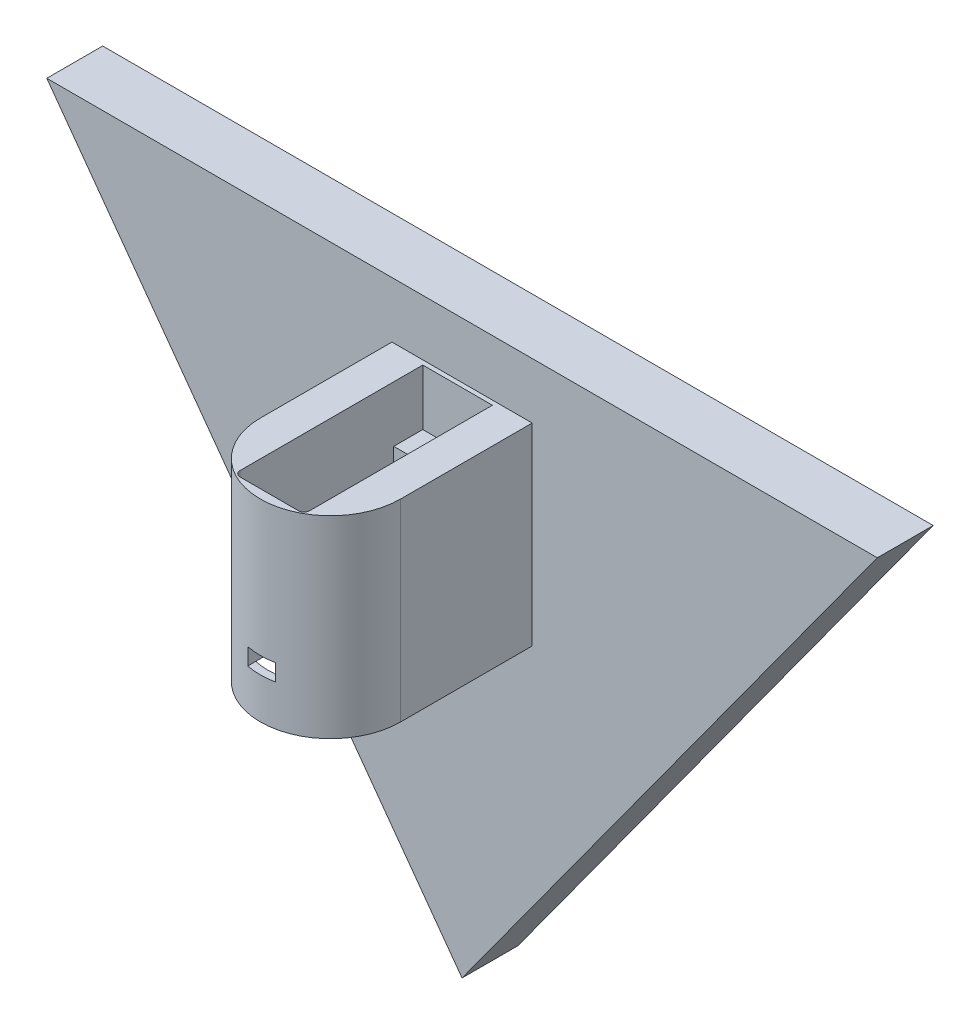
ISO-10303-21;
HEADER;
FILE_DESCRIPTION(('STEP AP214'),'2;1');
FILE_NAME('part.step','',(''),(''),'','','');
FILE_SCHEMA(('AUTOMOTIVE_DESIGN { 1 0 10303 214 1 1 1 1 }'));
ENDSEC;
DATA;
#1=APPLICATION_CONTEXT('core data for automotive mechanical design processes');
#2=APPLICATION_PROTOCOL_DEFINITION('international standard','automotive_design',2000,#1);
#3=PRODUCT_CONTEXT('',#1,'mechanical');
#4=PRODUCT('Part','Part','',(#3));
#5=PRODUCT_RELATED_PRODUCT_CATEGORY('part','',(#4));
#6=PRODUCT_DEFINITION_FORMATION('','',#4);
#7=PRODUCT_DEFINITION_CONTEXT('part definition',#1,'design');
#8=PRODUCT_DEFINITION('design','',#6,#7);
#9=PRODUCT_DEFINITION_SHAPE('','',#8);
#10=(LENGTH_UNIT() NAMED_UNIT(*) SI_UNIT(.MILLI.,.METRE.));
#11=(NAMED_UNIT(*) PLANE_ANGLE_UNIT() SI_UNIT($,.RADIAN.));
#12=(NAMED_UNIT(*) SI_UNIT($,.STERADIAN.) SOLID_ANGLE_UNIT());
#13=UNCERTAINTY_MEASURE_WITH_UNIT(LENGTH_MEASURE(1.E-05),#10,'distance_accuracy_value','');
#14=(GEOMETRIC_REPRESENTATION_CONTEXT(3) GLOBAL_UNCERTAINTY_ASSIGNED_CONTEXT((#13)) GLOBAL_UNIT_ASSIGNED_CONTEXT((#10,
#11,#12)) REPRESENTATION_CONTEXT('',''));
#15=CARTESIAN_POINT('',(0.,0.,0.));
#16=DIRECTION('',(0.,0.,1.));
#17=DIRECTION('',(1.,0.,0.));
#18=AXIS2_PLACEMENT_3D('',#15,#16,#17);
#19=CARTESIAN_POINT('',(-6.23,7.27500000000001,6.));
#20=DIRECTION('',(0.,-1.,0.));
#21=DIRECTION('',(0.,0.,-1.));
#22=AXIS2_PLACEMENT_3D('',#19,#20,#21);
#23=PLANE('',#22);
#24=DIRECTION('',(-1.,0.,0.));
#25=VECTOR('',#24,1.);
#26=CARTESIAN_POINT('',(-6.23,7.27500000000001,29.7));
#27=LINE('',#26,#25);
#28=CARTESIAN_POINT('',(0.,7.27500000000001,29.7));
#29=VERTEX_POINT('',#28);
#30=CARTESIAN_POINT('',(-6.23,7.27500000000001,29.7));
#31=VERTEX_POINT('',#30);
#32=EDGE_CURVE('E360',#29,#31,#27,.T.);
#33=ORIENTED_EDGE('',*,*,#32,.T.);
#34=DIRECTION('',(0.,0.,1.));
#35=VECTOR('',#34,1.);
#36=CARTESIAN_POINT('',(-6.23,7.27500000000001,0.8));
#37=LINE('',#36,#35);
#38=CARTESIAN_POINT('',(-6.23,7.27500000000001,33.5));
#39=VERTEX_POINT('',#38);
#40=EDGE_CURVE('E11',#31,#39,#37,.T.);
#41=ORIENTED_EDGE('',*,*,#40,.T.);
#42=CARTESIAN_POINT('',(-5.23,7.27500000000001,33.5));
#43=DIRECTION('',(0.,1.,0.));
#44=DIRECTION('',(0.,0.,1.));
#45=AXIS2_PLACEMENT_3D('',#42,#43,#44);
#46=CIRCLE('',#45,1.);
#47=CARTESIAN_POINT('',(-5.23,7.27500000000001,34.5));
#48=VERTEX_POINT('',#47);
#49=EDGE_CURVE('E263',#39,#48,#46,.T.);
#50=ORIENTED_EDGE('',*,*,#49,.T.);
#51=DIRECTION('',(1.,0.,0.));
#52=VECTOR('',#51,1.);
#53=CARTESIAN_POINT('',(-5.23,7.27500000000001,34.5));
#54=LINE('',#53,#52);
#55=CARTESIAN_POINT('',(-0.979795897113272,7.27500000000001,34.5));
#56=VERTEX_POINT('',#55);
#57=EDGE_CURVE('E261',#48,#56,#54,.T.);
#58=ORIENTED_EDGE('',*,*,#57,.T.);
#59=CARTESIAN_POINT('',(0.,7.27500000000001,32.2));
#60=DIRECTION('',(0.,-1.,0.));
#61=DIRECTION('',(0.,0.,-1.));
#62=AXIS2_PLACEMENT_3D('',#59,#60,#61);
#63=CIRCLE('',#62,2.5);
#64=EDGE_CURVE('E406',#56,#29,#63,.T.);
#65=ORIENTED_EDGE('',*,*,#64,.T.);
#66=EDGE_LOOP('',(#33,#41,#50,#58,#65));
#67=FACE_BOUND('',#66,.T.);
#68=ADVANCED_FACE('F41',(#67),#23,.F.);
#69=CARTESIAN_POINT('',(0.979795897113266,7.27500000000001,34.5));
#70=VERTEX_POINT('',#69);
#71=EDGE_CURVE('E407',#29,#70,#63,.T.);
#72=ORIENTED_EDGE('',*,*,#71,.T.);
#73=CARTESIAN_POINT('',(5.23,7.27500000000001,34.5));
#74=VERTEX_POINT('',#73);
#75=EDGE_CURVE('E51',#70,#74,#54,.T.);
#76=ORIENTED_EDGE('',*,*,#75,.T.);
#77=CARTESIAN_POINT('',(5.23,7.27500000000001,33.5));
#78=DIRECTION('',(0.,1.,0.));
#79=DIRECTION('',(0.,0.,1.));
#80=AXIS2_PLACEMENT_3D('',#77,#78,#79);
#81=CIRCLE('',#80,1.00000000000001);
#82=CARTESIAN_POINT('',(6.23,7.27500000000001,33.5));
#83=VERTEX_POINT('',#82);
#84=EDGE_CURVE('E266',#74,#83,#81,.T.);
#85=ORIENTED_EDGE('',*,*,#84,.T.);
#86=DIRECTION('',(0.,0.,-1.));
#87=VECTOR('',#86,1.);
#88=CARTESIAN_POINT('',(6.23,7.27500000000001,0.8));
#89=LINE('',#88,#87);
#90=CARTESIAN_POINT('',(6.23,7.27500000000001,29.7));
#91=VERTEX_POINT('',#90);
#92=EDGE_CURVE('E272',#83,#91,#89,.T.);
#93=ORIENTED_EDGE('',*,*,#92,.T.);
#94=EDGE_CURVE('E367',#91,#29,#27,.T.);
#95=ORIENTED_EDGE('',*,*,#94,.T.);
#96=EDGE_LOOP('',(#72,#76,#85,#93,#95));
#97=FACE_BOUND('',#96,.T.);
#98=ADVANCED_FACE('F440',(#97),#23,.F.);
#99=CARTESIAN_POINT('',(-6.23,-9.975,6.));
#100=DIRECTION('',(0.,1.,0.));
#101=DIRECTION('',(-1.,0.,0.));
#102=AXIS2_PLACEMENT_3D('',#99,#100,#101);
#103=PLANE('',#102);
#104=DIRECTION('',(0.,0.,1.));
#105=VECTOR('',#104,1.);
#106=CARTESIAN_POINT('',(2.5,-9.975,-0.001000000000001));
#107=LINE('',#106,#105);
#108=CARTESIAN_POINT('',(2.5,-9.975,29.7));
#109=VERTEX_POINT('',#108);
#110=CARTESIAN_POINT('',(2.5,-9.975,34.4161170617659));
#111=VERTEX_POINT('',#110);
#112=EDGE_CURVE('E340',#109,#111,#107,.T.);
#113=ORIENTED_EDGE('',*,*,#112,.F.);
#114=DIRECTION('',(1.,0.,0.));
#115=VECTOR('',#114,1.);
#116=CARTESIAN_POINT('',(-6.23000000000002,-9.975,29.7));
#117=LINE('',#116,#115);
#118=CARTESIAN_POINT('',(6.23,-9.97499999999999,29.7));
#119=VERTEX_POINT('',#118);
#120=EDGE_CURVE('E368',#109,#119,#117,.T.);
#121=ORIENTED_EDGE('',*,*,#120,.T.);
#122=DIRECTION('',(0.,0.,-1.));
#123=VECTOR('',#122,1.);
#124=CARTESIAN_POINT('',(6.23,-9.97499999999999,29.7));
#125=LINE('',#124,#123);
#126=CARTESIAN_POINT('',(6.23,-9.97499999999999,14.3028599015696));
#127=VERTEX_POINT('',#126);
#128=EDGE_CURVE('E362',#119,#127,#125,.T.);
#129=ORIENTED_EDGE('',*,*,#128,.T.);
#130=CARTESIAN_POINT('',(0.,-9.97499999999999,23.55));
#131=DIRECTION('',(0.,1.,0.));
#132=DIRECTION('',(-1.,0.,0.));
#133=AXIS2_PLACEMENT_3D('',#130,#131,#132);
#134=CIRCLE('',#133,11.15);
#135=EDGE_CURVE('E354',#111,#127,#134,.T.);
#136=ORIENTED_EDGE('',*,*,#135,.F.);
#137=EDGE_LOOP('',(#113,#121,#129,#136));
#138=FACE_BOUND('',#137,.T.);
#139=ADVANCED_FACE('F475',(#138),#103,.F.);
#140=CARTESIAN_POINT('',(-6.23,-53.9370800671778,29.7));
#141=DIRECTION('',(0.,0.,-1.));
#142=DIRECTION('',(-1.,0.,0.));
#143=AXIS2_PLACEMENT_3D('',#140,#141,#142);
#144=PLANE('',#143);
#145=DIRECTION('',(-1.,0.,0.));
#146=VECTOR('',#145,1.);
#147=CARTESIAN_POINT('',(-2.5,-6.975,29.7));
#148=LINE('',#147,#146);
#149=CARTESIAN_POINT('',(2.5,-6.975,29.7));
#150=VERTEX_POINT('',#149);
#151=CARTESIAN_POINT('',(-2.5,-6.975,29.7));
#152=VERTEX_POINT('',#151);
#153=EDGE_CURVE('E322',#150,#152,#148,.T.);
#154=ORIENTED_EDGE('',*,*,#153,.T.);
#155=DIRECTION('',(0.,-1.,0.));
#156=VECTOR('',#155,1.);
#157=CARTESIAN_POINT('',(-2.5,-6.975,29.7));
#158=LINE('',#157,#156);
#159=CARTESIAN_POINT('',(-2.5,-9.975,29.7));
#160=VERTEX_POINT('',#159);
#161=EDGE_CURVE('E329',#152,#160,#158,.T.);
#162=ORIENTED_EDGE('',*,*,#161,.T.);
#163=CARTESIAN_POINT('',(-6.23,-9.975,29.7));
#164=VERTEX_POINT('',#163);
#165=EDGE_CURVE('E388',#164,#160,#117,.T.);
#166=ORIENTED_EDGE('',*,*,#165,.F.);
#167=DIRECTION('',(0.,1.,0.));
#168=VECTOR('',#167,1.);
#169=CARTESIAN_POINT('',(-6.23,-53.9370800671778,29.7));
#170=LINE('',#169,#168);
#171=EDGE_CURVE('E382',#164,#31,#170,.T.);
#172=ORIENTED_EDGE('',*,*,#171,.T.);
#173=ORIENTED_EDGE('',*,*,#32,.F.);
#174=ORIENTED_EDGE('',*,*,#94,.F.);
#175=DIRECTION('',(0.,1.,0.));
#176=VECTOR('',#175,1.);
#177=CARTESIAN_POINT('',(6.23,-53.9370800671778,29.7));
#178=LINE('',#177,#176);
#179=EDGE_CURVE('E375',#119,#91,#178,.T.);
#180=ORIENTED_EDGE('',*,*,#179,.F.);
#181=ORIENTED_EDGE('',*,*,#120,.F.);
#182=DIRECTION('',(0.,1.,0.));
#183=VECTOR('',#182,1.);
#184=CARTESIAN_POINT('',(2.5,-6.975,29.7));
#185=LINE('',#184,#183);
#186=EDGE_CURVE('E323',#109,#150,#185,.T.);
#187=ORIENTED_EDGE('',*,*,#186,.T.);
#188=EDGE_LOOP('',(#154,#162,#166,#172,#173,#174,#180,#181,#187));
#189=FACE_BOUND('',#188,.T.);
#190=ADVANCED_FACE('F445',(#189),#144,.T.);
#191=DIRECTION('',(-1.,0.,0.));
#192=VECTOR('',#191,1.);
#193=CARTESIAN_POINT('',(-6.23,7.27500000000001,0.8));
#194=LINE('',#193,#192);
#195=CARTESIAN_POINT('',(6.23,7.27500000000001,0.8));
#196=VERTEX_POINT('',#195);
#197=CARTESIAN_POINT('',(-6.23,7.27500000000001,0.799999999999999));
#198=VERTEX_POINT('',#197);
#199=EDGE_CURVE('E249',#196,#198,#194,.T.);
#200=ORIENTED_EDGE('',*,*,#199,.T.);
#201=CARTESIAN_POINT('',(-6.23,7.27500000000001,6.));
#202=VERTEX_POINT('',#201);
#203=EDGE_CURVE('E52',#198,#202,#37,.T.);
#204=ORIENTED_EDGE('',*,*,#203,.T.);
#205=DIRECTION('',(-1.,0.,0.));
#206=VECTOR('',#205,1.);
#207=CARTESIAN_POINT('',(-6.23,7.27500000000001,6.));
#208=LINE('',#207,#206);
#209=CARTESIAN_POINT('',(0.,7.27500000000001,6.));
#210=VERTEX_POINT('',#209);
#211=EDGE_CURVE('E396',#210,#202,#208,.T.);
#212=ORIENTED_EDGE('',*,*,#211,.F.);
#213=CARTESIAN_POINT('',(0.,7.27500000000001,3.5));
#214=DIRECTION('',(0.,-1.,0.));
#215=DIRECTION('',(0.,0.,-1.));
#216=AXIS2_PLACEMENT_3D('',#213,#214,#215);
#217=CIRCLE('',#216,2.5);
#218=EDGE_CURVE('E403',#210,#210,#217,.T.);
#219=ORIENTED_EDGE('',*,*,#218,.T.);
#220=CARTESIAN_POINT('',(6.23,7.27500000000001,6.));
#221=VERTEX_POINT('',#220);
#222=EDGE_CURVE('E397',#221,#210,#208,.T.);
#223=ORIENTED_EDGE('',*,*,#222,.F.);
#224=EDGE_CURVE('E271',#221,#196,#89,.T.);
#225=ORIENTED_EDGE('',*,*,#224,.T.);
#226=EDGE_LOOP('',(#200,#204,#212,#219,#223,#225));
#227=FACE_BOUND('',#226,.T.);
#228=ADVANCED_FACE('F509',(#227),#23,.F.);
#229=CARTESIAN_POINT('',(0.,-53.9370800671778,23.55));
#230=DIRECTION('',(0.,1.,0.));
#231=DIRECTION('',(0.,0.,1.));
#232=AXIS2_PLACEMENT_3D('',#229,#230,#231);
#233=CYLINDRICAL_SURFACE('',#232,12.5467811820916);
#234=CARTESIAN_POINT('',(0.,-17.275,23.55));
#235=DIRECTION('',(0.,-1.,0.));
#236=DIRECTION('',(0.,0.,-1.));
#237=AXIS2_PLACEMENT_3D('',#234,#235,#236);
#238=CIRCLE('',#237,12.5467811820916);
#239=CARTESIAN_POINT('',(12.5467811820916,-17.275,23.55));
#240=VERTEX_POINT('',#239);
#241=CARTESIAN_POINT('',(-12.5467811820916,-17.275,23.55));
#242=VERTEX_POINT('',#241);
#243=EDGE_CURVE('E355',#240,#242,#238,.T.);
#244=ORIENTED_EDGE('',*,*,#243,.F.);
#245=DIRECTION('',(0.,1.,0.));
#246=VECTOR('',#245,1.);
#247=CARTESIAN_POINT('',(12.5467811820916,-53.9370800671778,23.55));
#248=LINE('',#247,#246);
#249=CARTESIAN_POINT('',(12.5467811820916,17.275,23.55));
#250=VERTEX_POINT('',#249);
#251=EDGE_CURVE('E376',#240,#250,#248,.T.);
#252=ORIENTED_EDGE('',*,*,#251,.T.);
#253=CARTESIAN_POINT('',(0.,17.275,23.55));
#254=DIRECTION('',(0.,1.,0.));
#255=DIRECTION('',(0.,0.,1.));
#256=AXIS2_PLACEMENT_3D('',#253,#254,#255);
#257=CIRCLE('',#256,12.5467811820916);
#258=CARTESIAN_POINT('',(-12.5467811820916,17.275,23.55));
#259=VERTEX_POINT('',#258);
#260=EDGE_CURVE('E293',#259,#250,#257,.T.);
#261=ORIENTED_EDGE('',*,*,#260,.F.);
#262=DIRECTION('',(0.,1.,0.));
#263=VECTOR('',#262,1.);
#264=CARTESIAN_POINT('',(-12.5467811820916,-53.9370800671778,23.55));
#265=LINE('',#264,#263);
#266=EDGE_CURVE('E67',#242,#259,#265,.T.);
#267=ORIENTED_EDGE('',*,*,#266,.F.);
#268=EDGE_LOOP('',(#244,#252,#261,#267));
#269=FACE_BOUND('',#268,.T.);
#270=CARTESIAN_POINT('',(0.,-9.975,23.55));
#271=DIRECTION('',(0.,-1.,0.));
#272=DIRECTION('',(0.,0.,-1.));
#273=AXIS2_PLACEMENT_3D('',#270,#271,#272);
#274=CIRCLE('',#273,12.5467811820916);
#275=CARTESIAN_POINT('',(2.5,-9.975,35.8451908497302));
#276=VERTEX_POINT('',#275);
#277=CARTESIAN_POINT('',(-2.5,-9.975,35.8451908497302));
#278=VERTEX_POINT('',#277);
#279=EDGE_CURVE('E309',#276,#278,#274,.T.);
#280=ORIENTED_EDGE('',*,*,#279,.T.);
#281=DIRECTION('',(0.,1.,0.));
#282=VECTOR('',#281,1.);
#283=CARTESIAN_POINT('',(-2.5,-53.9370800671778,35.8451908497302));
#284=LINE('',#283,#282);
#285=CARTESIAN_POINT('',(-2.5,-6.975,35.8451908497302));
#286=VERTEX_POINT('',#285);
#287=EDGE_CURVE('E313',#278,#286,#284,.T.);
#288=ORIENTED_EDGE('',*,*,#287,.T.);
#289=CARTESIAN_POINT('',(0.,-6.975,23.55));
#290=DIRECTION('',(0.,1.,0.));
#291=DIRECTION('',(0.,0.,1.));
#292=AXIS2_PLACEMENT_3D('',#289,#290,#291);
#293=CIRCLE('',#292,12.5467811820916);
#294=CARTESIAN_POINT('',(2.50000000000001,-6.975,35.8451908497302));
#295=VERTEX_POINT('',#294);
#296=EDGE_CURVE('E302',#286,#295,#293,.T.);
#297=ORIENTED_EDGE('',*,*,#296,.T.);
#298=DIRECTION('',(0.,1.,0.));
#299=VECTOR('',#298,1.);
#300=CARTESIAN_POINT('',(2.50000000000001,-53.9370800671778,35.8451908497302));
#301=LINE('',#300,#299);
#302=EDGE_CURVE('E312',#295,#276,#301,.F.);
#303=ORIENTED_EDGE('',*,*,#302,.T.);
#304=EDGE_LOOP('',(#280,#288,#297,#303));
#305=FACE_BOUND('',#304,.T.);
#306=ADVANCED_FACE('F483',(#269,#305),#233,.T.);
#307=CARTESIAN_POINT('',(0.,42.762656223683,23.55));
#308=DIRECTION('',(0.,-1.,0.));
#309=DIRECTION('',(0.,0.,-1.));
#310=AXIS2_PLACEMENT_3D('',#307,#308,#309);
#311=CYLINDRICAL_SURFACE('',#310,11.15);
#312=CARTESIAN_POINT('',(0.,-17.275,23.55));
#313=DIRECTION('',(0.,-1.,0.));
#314=DIRECTION('',(0.,0.,-1.));
#315=AXIS2_PLACEMENT_3D('',#312,#313,#314);
#316=CIRCLE('',#315,11.15);
#317=CARTESIAN_POINT('',(0.,-17.275,12.4));
#318=VERTEX_POINT('',#317);
#319=EDGE_CURVE('E349',#318,#318,#316,.T.);
#320=ORIENTED_EDGE('',*,*,#319,.T.);
#321=EDGE_LOOP('',(#320));
#322=FACE_BOUND('',#321,.T.);
#323=CARTESIAN_POINT('',(0.,-9.97499999999999,23.55));
#324=DIRECTION('',(0.,1.,0.));
#325=DIRECTION('',(-1.,0.,0.));
#326=AXIS2_PLACEMENT_3D('',#323,#324,#325);
#327=CIRCLE('',#326,11.15);
#328=CARTESIAN_POINT('',(-6.23,-9.97499999999999,14.3028599015696));
#329=VERTEX_POINT('',#328);
#330=EDGE_CURVE('E46',#329,#127,#327,.F.);
#331=ORIENTED_EDGE('',*,*,#330,.F.);
#332=CARTESIAN_POINT('',(-2.5,-9.975,34.4161170617659));
#333=VERTEX_POINT('',#332);
#334=EDGE_CURVE('E358',#329,#333,#134,.T.);
#335=ORIENTED_EDGE('',*,*,#334,.T.);
#336=EDGE_CURVE('E359',#333,#111,#134,.T.);
#337=ORIENTED_EDGE('',*,*,#336,.T.);
#338=ORIENTED_EDGE('',*,*,#135,.T.);
#339=EDGE_LOOP('',(#331,#335,#337,#338));
#340=FACE_BOUND('',#339,.T.);
#341=ADVANCED_FACE('F524',(#322,#340),#311,.F.);
#342=ORIENTED_EDGE('',*,*,#165,.T.);
#343=DIRECTION('',(0.,0.,1.));
#344=VECTOR('',#343,1.);
#345=CARTESIAN_POINT('',(-2.5,-9.975,-0.001000000000001));
#346=LINE('',#345,#344);
#347=EDGE_CURVE('E343',#160,#333,#346,.T.);
#348=ORIENTED_EDGE('',*,*,#347,.T.);
#349=ORIENTED_EDGE('',*,*,#334,.F.);
#350=DIRECTION('',(0.,0.,1.));
#351=VECTOR('',#350,1.);
#352=CARTESIAN_POINT('',(-6.23,-9.975,0.));
#353=LINE('',#352,#351);
#354=EDGE_CURVE('E364',#329,#164,#353,.T.);
#355=ORIENTED_EDGE('',*,*,#354,.T.);
#356=EDGE_LOOP('',(#342,#348,#349,#355));
#357=FACE_BOUND('',#356,.T.);
#358=ADVANCED_FACE('F490',(#357),#103,.F.);
#359=CARTESIAN_POINT('',(0.,0.,6.));
#360=DIRECTION('',(0.,0.,-1.));
#361=DIRECTION('',(-1.,0.,0.));
#362=AXIS2_PLACEMENT_3D('',#359,#360,#361);
#363=PLANE('',#362);
#364=DIRECTION('',(0.,-1.,0.));
#365=VECTOR('',#364,1.);
#366=CARTESIAN_POINT('',(-6.23,-9.975,6.));
#367=LINE('',#366,#365);
#368=CARTESIAN_POINT('',(-6.23,-9.975,6.));
#369=VERTEX_POINT('',#368);
#370=EDGE_CURVE('E387',#202,#369,#367,.T.);
#371=ORIENTED_EDGE('',*,*,#370,.T.);
#372=DIRECTION('',(1.,0.,0.));
#373=VECTOR('',#372,1.);
#374=CARTESIAN_POINT('',(-6.23,-9.975,6.));
#375=LINE('',#374,#373);
#376=CARTESIAN_POINT('',(6.23,-9.97499999999999,6.));
#377=VERTEX_POINT('',#376);
#378=EDGE_CURVE('E394',#369,#377,#375,.T.);
#379=ORIENTED_EDGE('',*,*,#378,.T.);
#380=DIRECTION('',(0.,1.,0.));
#381=VECTOR('',#380,1.);
#382=CARTESIAN_POINT('',(6.23,-9.97499999999999,6.));
#383=LINE('',#382,#381);
#384=EDGE_CURVE('E391',#377,#221,#383,.T.);
#385=ORIENTED_EDGE('',*,*,#384,.T.);
#386=ORIENTED_EDGE('',*,*,#222,.T.);
#387=ORIENTED_EDGE('',*,*,#211,.T.);
#388=EDGE_LOOP('',(#371,#379,#385,#386,#387));
#389=FACE_BOUND('',#388,.T.);
#390=ADVANCED_FACE('F527',(#389),#363,.F.);
#391=CARTESIAN_POINT('',(-6.23,-53.9370800671778,0.));
#392=DIRECTION('',(1.,0.,0.));
#393=DIRECTION('',(0.,0.,-1.));
#394=AXIS2_PLACEMENT_3D('',#391,#392,#393);
#395=PLANE('',#394);
#396=ORIENTED_EDGE('',*,*,#370,.F.);
#397=ORIENTED_EDGE('',*,*,#203,.F.);
#398=DIRECTION('',(0.,-1.,0.));
#399=VECTOR('',#398,1.);
#400=CARTESIAN_POINT('',(-6.23,17.275,0.8));
#401=LINE('',#400,#399);
#402=CARTESIAN_POINT('',(-6.23,17.275,0.8));
#403=VERTEX_POINT('',#402);
#404=EDGE_CURVE('E58',#403,#198,#401,.T.);
#405=ORIENTED_EDGE('',*,*,#404,.F.);
#406=DIRECTION('',(0.,0.,1.));
#407=VECTOR('',#406,1.);
#408=CARTESIAN_POINT('',(-6.23,17.275,0.8));
#409=LINE('',#408,#407);
#410=CARTESIAN_POINT('',(-6.23,17.275,33.5));
#411=VERTEX_POINT('',#410);
#412=EDGE_CURVE('E250',#403,#411,#409,.T.);
#413=ORIENTED_EDGE('',*,*,#412,.T.);
#414=DIRECTION('',(0.,-1.,0.));
#415=VECTOR('',#414,1.);
#416=CARTESIAN_POINT('',(-6.23,17.275,33.5));
#417=LINE('',#416,#415);
#418=EDGE_CURVE('E281',#411,#39,#417,.T.);
#419=ORIENTED_EDGE('',*,*,#418,.T.);
#420=ORIENTED_EDGE('',*,*,#40,.F.);
#421=ORIENTED_EDGE('',*,*,#171,.F.);
#422=ORIENTED_EDGE('',*,*,#354,.F.);
#423=EDGE_CURVE('E363',#369,#329,#353,.T.);
#424=ORIENTED_EDGE('',*,*,#423,.F.);
#425=EDGE_LOOP('',(#396,#397,#405,#413,#419,#420,#421,#422,#424));
#426=FACE_BOUND('',#425,.T.);
#427=ADVANCED_FACE('F492',(#426),#395,.T.);
#428=CARTESIAN_POINT('',(6.23,-53.9370800671778,29.7));
#429=DIRECTION('',(-1.,0.,0.));
#430=DIRECTION('',(0.,0.,1.));
#431=AXIS2_PLACEMENT_3D('',#428,#429,#430);
#432=PLANE('',#431);
#433=EDGE_CURVE('E361',#127,#377,#125,.T.);
#434=ORIENTED_EDGE('',*,*,#433,.F.);
#435=ORIENTED_EDGE('',*,*,#128,.F.);
#436=ORIENTED_EDGE('',*,*,#179,.T.);
#437=ORIENTED_EDGE('',*,*,#92,.F.);
#438=DIRECTION('',(0.,-1.,0.));
#439=VECTOR('',#438,1.);
#440=CARTESIAN_POINT('',(6.23,17.275,33.5));
#441=LINE('',#440,#439);
#442=CARTESIAN_POINT('',(6.23,17.275,33.5));
#443=VERTEX_POINT('',#442);
#444=EDGE_CURVE('E277',#443,#83,#441,.T.);
#445=ORIENTED_EDGE('',*,*,#444,.F.);
#446=DIRECTION('',(0.,0.,-1.));
#447=VECTOR('',#446,1.);
#448=CARTESIAN_POINT('',(6.23,17.275,0.8));
#449=LINE('',#448,#447);
#450=CARTESIAN_POINT('',(6.23,17.275,0.799999999999999));
#451=VERTEX_POINT('',#450);
#452=EDGE_CURVE('E258',#443,#451,#449,.T.);
#453=ORIENTED_EDGE('',*,*,#452,.T.);
#454=DIRECTION('',(0.,-1.,0.));
#455=VECTOR('',#454,1.);
#456=CARTESIAN_POINT('',(6.23,17.275,0.8));
#457=LINE('',#456,#455);
#458=EDGE_CURVE('E280',#451,#196,#457,.T.);
#459=ORIENTED_EDGE('',*,*,#458,.T.);
#460=ORIENTED_EDGE('',*,*,#224,.F.);
#461=ORIENTED_EDGE('',*,*,#384,.F.);
#462=EDGE_LOOP('',(#434,#435,#436,#437,#445,#453,#459,#460,#461));
#463=FACE_BOUND('',#462,.T.);
#464=ADVANCED_FACE('F464',(#463),#432,.T.);
#465=CARTESIAN_POINT('',(12.5467811820916,-53.9370800671778,23.55));
#466=DIRECTION('',(1.,0.,0.));
#467=DIRECTION('',(0.,0.,-1.));
#468=AXIS2_PLACEMENT_3D('',#465,#466,#467);
#469=PLANE('',#468);
#470=ORIENTED_EDGE('',*,*,#251,.F.);
#471=DIRECTION('',(0.,0.,1.));
#472=VECTOR('',#471,1.);
#473=CARTESIAN_POINT('',(12.5467811820916,-17.275,0.));
#474=LINE('',#473,#472);
#475=CARTESIAN_POINT('',(12.5467811820916,-17.275,0.));
#476=VERTEX_POINT('',#475);
#477=EDGE_CURVE('E301',#476,#240,#474,.T.);
#478=ORIENTED_EDGE('',*,*,#477,.F.);
#479=DIRECTION('',(0.,1.,0.));
#480=VECTOR('',#479,1.);
#481=CARTESIAN_POINT('',(12.5467811820916,-53.9370800671778,0.));
#482=LINE('',#481,#480);
#483=CARTESIAN_POINT('',(12.5467811820916,17.275,0.));
#484=VERTEX_POINT('',#483);
#485=EDGE_CURVE('E373',#476,#484,#482,.T.);
#486=ORIENTED_EDGE('',*,*,#485,.T.);
#487=DIRECTION('',(0.,0.,-1.));
#488=VECTOR('',#487,1.);
#489=CARTESIAN_POINT('',(12.5467811820916,17.275,0.));
#490=LINE('',#489,#488);
#491=EDGE_CURVE('E295',#250,#484,#490,.T.);
#492=ORIENTED_EDGE('',*,*,#491,.F.);
#493=EDGE_LOOP('',(#470,#478,#486,#492));
#494=FACE_BOUND('',#493,.T.);
#495=ADVANCED_FACE('F567',(#494),#469,.T.);
#496=CARTESIAN_POINT('',(-12.5467811820916,-53.9370800671778,23.55));
#497=DIRECTION('',(-1.,0.,0.));
#498=DIRECTION('',(0.,0.,1.));
#499=AXIS2_PLACEMENT_3D('',#496,#497,#498);
#500=PLANE('',#499);
#501=DIRECTION('',(0.,1.,0.));
#502=VECTOR('',#501,1.);
#503=CARTESIAN_POINT('',(-12.5467811820916,-53.9370800671778,0.));
#504=LINE('',#503,#502);
#505=CARTESIAN_POINT('',(-12.5467811820916,-17.275,0.));
#506=VERTEX_POINT('',#505);
#507=CARTESIAN_POINT('',(-12.5467811820916,17.275,0.));
#508=VERTEX_POINT('',#507);
#509=EDGE_CURVE('E378',#506,#508,#504,.T.);
#510=ORIENTED_EDGE('',*,*,#509,.F.);
#511=DIRECTION('',(0.,0.,-1.));
#512=VECTOR('',#511,1.);
#513=CARTESIAN_POINT('',(-12.5467811820916,-17.275,23.55));
#514=LINE('',#513,#512);
#515=EDGE_CURVE('E297',#242,#506,#514,.T.);
#516=ORIENTED_EDGE('',*,*,#515,.F.);
#517=ORIENTED_EDGE('',*,*,#266,.T.);
#518=DIRECTION('',(0.,0.,1.));
#519=VECTOR('',#518,1.);
#520=CARTESIAN_POINT('',(-12.5467811820916,17.275,0.));
#521=LINE('',#520,#519);
#522=EDGE_CURVE('E286',#508,#259,#521,.T.);
#523=ORIENTED_EDGE('',*,*,#522,.F.);
#524=EDGE_LOOP('',(#510,#516,#517,#523));
#525=FACE_BOUND('',#524,.T.);
#526=ADVANCED_FACE('F571',(#525),#500,.T.);
#527=CARTESIAN_POINT('',(0.,-17.275,23.55));
#528=DIRECTION('',(0.,-1.,0.));
#529=DIRECTION('',(0.,0.,-1.));
#530=AXIS2_PLACEMENT_3D('',#527,#528,#529);
#531=PLANE('',#530);
#532=ORIENTED_EDGE('',*,*,#243,.T.);
#533=ORIENTED_EDGE('',*,*,#515,.T.);
#534=DIRECTION('',(1.,0.,0.));
#535=VECTOR('',#534,1.);
#536=CARTESIAN_POINT('',(-12.5467811820916,-17.275,0.));
#537=LINE('',#536,#535);
#538=EDGE_CURVE('E304',#506,#476,#537,.T.);
#539=ORIENTED_EDGE('',*,*,#538,.T.);
#540=ORIENTED_EDGE('',*,*,#477,.T.);
#541=EDGE_LOOP('',(#532,#533,#539,#540));
#542=FACE_BOUND('',#541,.T.);
#543=ORIENTED_EDGE('',*,*,#319,.F.);
#544=EDGE_LOOP('',(#543));
#545=FACE_BOUND('',#544,.T.);
#546=ADVANCED_FACE('F570',(#542,#545),#531,.T.);
#547=CARTESIAN_POINT('',(0.,2.27500000000001,32.2));
#548=DIRECTION('',(0.,1.,0.));
#549=DIRECTION('',(0.,0.,1.));
#550=AXIS2_PLACEMENT_3D('',#547,#548,#549);
#551=CYLINDRICAL_SURFACE('',#550,2.);
#552=CARTESIAN_POINT('',(0.,6.40897459621557,32.2));
#553=DIRECTION('',(0.,-1.,0.));
#554=DIRECTION('',(0.,0.,-1.));
#555=AXIS2_PLACEMENT_3D('',#552,#553,#554);
#556=CIRCLE('',#555,2.);
#557=CARTESIAN_POINT('',(0.,6.40897459621557,30.2));
#558=VERTEX_POINT('',#557);
#559=EDGE_CURVE('E405',#558,#558,#556,.F.);
#560=ORIENTED_EDGE('',*,*,#559,.T.);
#561=EDGE_LOOP('',(#560));
#562=FACE_BOUND('',#561,.T.);
#563=CARTESIAN_POINT('',(0.,2.27500000000001,32.2));
#564=DIRECTION('',(0.,1.,0.));
#565=DIRECTION('',(0.,0.,1.));
#566=AXIS2_PLACEMENT_3D('',#563,#564,#565);
#567=CIRCLE('',#566,2.);
#568=CARTESIAN_POINT('',(0.,2.27500000000001,34.2));
#569=VERTEX_POINT('',#568);
#570=EDGE_CURVE('E331',#569,#569,#567,.T.);
#571=ORIENTED_EDGE('',*,*,#570,.F.);
#572=EDGE_LOOP('',(#571));
#573=FACE_BOUND('',#572,.T.);
#574=ADVANCED_FACE('F697',(#562,#573),#551,.F.);
#575=CARTESIAN_POINT('',(0.,2.27500000000001,32.2));
#576=DIRECTION('',(0.,1.,0.));
#577=DIRECTION('',(0.,0.,1.));
#578=AXIS2_PLACEMENT_3D('',#575,#576,#577);
#579=PLANE('',#578);
#580=ORIENTED_EDGE('',*,*,#570,.T.);
#581=EDGE_LOOP('',(#580));
#582=FACE_BOUND('',#581,.T.);
#583=ADVANCED_FACE('F743',(#582),#579,.T.);
#584=CARTESIAN_POINT('',(0.,2.27500000000001,3.5));
#585=DIRECTION('',(0.,1.,0.));
#586=DIRECTION('',(0.,0.,1.));
#587=AXIS2_PLACEMENT_3D('',#584,#585,#586);
#588=CYLINDRICAL_SURFACE('',#587,2.);
#589=CARTESIAN_POINT('',(0.,6.40897459621556,3.5));
#590=DIRECTION('',(0.,-1.,0.));
#591=DIRECTION('',(0.,0.,-1.));
#592=AXIS2_PLACEMENT_3D('',#589,#590,#591);
#593=CIRCLE('',#592,2.);
#594=CARTESIAN_POINT('',(0.,6.40897459621556,1.5));
#595=VERTEX_POINT('',#594);
#596=EDGE_CURVE('E413',#595,#595,#593,.F.);
#597=ORIENTED_EDGE('',*,*,#596,.T.);
#598=EDGE_LOOP('',(#597));
#599=FACE_BOUND('',#598,.T.);
#600=CARTESIAN_POINT('',(0.,2.27500000000001,3.5));
#601=DIRECTION('',(0.,1.,0.));
#602=DIRECTION('',(0.,0.,1.));
#603=AXIS2_PLACEMENT_3D('',#600,#601,#602);
#604=CIRCLE('',#603,2.);
#605=CARTESIAN_POINT('',(0.,2.27500000000001,5.5));
#606=VERTEX_POINT('',#605);
#607=EDGE_CURVE('E342',#606,#606,#604,.T.);
#608=ORIENTED_EDGE('',*,*,#607,.F.);
#609=EDGE_LOOP('',(#608));
#610=FACE_BOUND('',#609,.T.);
#611=ADVANCED_FACE('F548',(#599,#610),#588,.F.);
#612=CARTESIAN_POINT('',(0.,2.27500000000001,3.5));
#613=DIRECTION('',(0.,1.,0.));
#614=DIRECTION('',(0.,0.,1.));
#615=AXIS2_PLACEMENT_3D('',#612,#613,#614);
#616=PLANE('',#615);
#617=ORIENTED_EDGE('',*,*,#607,.T.);
#618=EDGE_LOOP('',(#617));
#619=FACE_BOUND('',#618,.T.);
#620=ADVANCED_FACE('F543',(#619),#616,.T.);
#621=CARTESIAN_POINT('',(0.,6.40897459621557,32.2));
#622=DIRECTION('',(0.,1.,0.));
#623=DIRECTION('',(0.,0.,1.));
#624=AXIS2_PLACEMENT_3D('',#621,#622,#623);
#625=CONICAL_SURFACE('',#624,2.,0.523598775598295);
#626=ORIENTED_EDGE('',*,*,#71,.F.);
#627=ORIENTED_EDGE('',*,*,#64,.F.);
#628=EDGE_CURVE('E414',#70,#56,#63,.T.);
#629=ORIENTED_EDGE('',*,*,#628,.F.);
#630=EDGE_LOOP('',(#626,#627,#629));
#631=FACE_BOUND('',#630,.T.);
#632=ORIENTED_EDGE('',*,*,#559,.F.);
#633=EDGE_LOOP('',(#632));
#634=FACE_BOUND('',#633,.T.);
#635=ADVANCED_FACE('F432',(#631,#634),#625,.F.);
#636=CARTESIAN_POINT('',(0.,6.40897459621556,3.5));
#637=DIRECTION('',(0.,1.,0.));
#638=DIRECTION('',(0.,0.,1.));
#639=AXIS2_PLACEMENT_3D('',#636,#637,#638);
#640=CONICAL_SURFACE('',#639,2.,0.523598775598295);
#641=ORIENTED_EDGE('',*,*,#218,.F.);
#642=EDGE_LOOP('',(#641));
#643=FACE_BOUND('',#642,.T.);
#644=ORIENTED_EDGE('',*,*,#596,.F.);
#645=EDGE_LOOP('',(#644));
#646=FACE_BOUND('',#645,.T.);
#647=ADVANCED_FACE('F42',(#643,#646),#640,.F.);
#648=CARTESIAN_POINT('',(-6.23,-9.975,6.));
#649=DIRECTION('',(0.,1.,0.));
#650=DIRECTION('',(-1.,0.,0.));
#651=AXIS2_PLACEMENT_3D('',#648,#649,#650);
#652=PLANE('',#651);
#653=ORIENTED_EDGE('',*,*,#423,.T.);
#654=ORIENTED_EDGE('',*,*,#330,.T.);
#655=ORIENTED_EDGE('',*,*,#433,.T.);
#656=ORIENTED_EDGE('',*,*,#378,.F.);
#657=EDGE_LOOP('',(#653,#654,#655,#656));
#658=FACE_BOUND('',#657,.T.);
#659=ADVANCED_FACE('F531',(#658),#652,.T.);
#660=CARTESIAN_POINT('',(-2.5,-9.975,-0.001000000000001));
#661=DIRECTION('',(0.,-1.,0.));
#662=DIRECTION('',(0.,0.,-1.));
#663=AXIS2_PLACEMENT_3D('',#660,#661,#662);
#664=PLANE('',#663);
#665=EDGE_CURVE('E326',#333,#278,#346,.T.);
#666=ORIENTED_EDGE('',*,*,#665,.T.);
#667=ORIENTED_EDGE('',*,*,#279,.F.);
#668=EDGE_CURVE('E338',#111,#276,#107,.T.);
#669=ORIENTED_EDGE('',*,*,#668,.F.);
#670=ORIENTED_EDGE('',*,*,#336,.F.);
#671=EDGE_LOOP('',(#666,#667,#669,#670));
#672=FACE_BOUND('',#671,.T.);
#673=ADVANCED_FACE('F536',(#672),#664,.F.);
#674=CARTESIAN_POINT('',(2.5,-6.975,-0.001000000000001));
#675=DIRECTION('',(1.,0.,0.));
#676=DIRECTION('',(0.,1.,0.));
#677=AXIS2_PLACEMENT_3D('',#674,#675,#676);
#678=PLANE('',#677);
#679=DIRECTION('',(0.,0.,1.));
#680=VECTOR('',#679,1.);
#681=CARTESIAN_POINT('',(2.5,-6.975,-0.001000000000001));
#682=LINE('',#681,#680);
#683=EDGE_CURVE('E332',#150,#295,#682,.T.);
#684=ORIENTED_EDGE('',*,*,#683,.F.);
#685=ORIENTED_EDGE('',*,*,#186,.F.);
#686=ORIENTED_EDGE('',*,*,#112,.T.);
#687=ORIENTED_EDGE('',*,*,#668,.T.);
#688=ORIENTED_EDGE('',*,*,#302,.F.);
#689=EDGE_LOOP('',(#684,#685,#686,#687,#688));
#690=FACE_BOUND('',#689,.T.);
#691=ADVANCED_FACE('F478',(#690),#678,.F.);
#692=CARTESIAN_POINT('',(-2.5,-6.975,-0.001000000000001));
#693=DIRECTION('',(0.,1.,0.));
#694=DIRECTION('',(0.,0.,1.));
#695=AXIS2_PLACEMENT_3D('',#692,#693,#694);
#696=PLANE('',#695);
#697=ORIENTED_EDGE('',*,*,#296,.F.);
#698=DIRECTION('',(0.,0.,1.));
#699=VECTOR('',#698,1.);
#700=CARTESIAN_POINT('',(-2.5,-6.975,-0.001000000000001));
#701=LINE('',#700,#699);
#702=EDGE_CURVE('E333',#152,#286,#701,.T.);
#703=ORIENTED_EDGE('',*,*,#702,.F.);
#704=ORIENTED_EDGE('',*,*,#153,.F.);
#705=ORIENTED_EDGE('',*,*,#683,.T.);
#706=EDGE_LOOP('',(#697,#703,#704,#705));
#707=FACE_BOUND('',#706,.T.);
#708=ADVANCED_FACE('F480',(#707),#696,.F.);
#709=CARTESIAN_POINT('',(-2.5,-6.975,-0.001000000000001));
#710=DIRECTION('',(-1.,0.,0.));
#711=DIRECTION('',(0.,-1.,0.));
#712=AXIS2_PLACEMENT_3D('',#709,#710,#711);
#713=PLANE('',#712);
#714=ORIENTED_EDGE('',*,*,#347,.F.);
#715=ORIENTED_EDGE('',*,*,#161,.F.);
#716=ORIENTED_EDGE('',*,*,#702,.T.);
#717=ORIENTED_EDGE('',*,*,#287,.F.);
#718=ORIENTED_EDGE('',*,*,#665,.F.);
#719=EDGE_LOOP('',(#714,#715,#716,#717,#718));
#720=FACE_BOUND('',#719,.T.);
#721=ADVANCED_FACE('F488',(#720),#713,.F.);
#722=CARTESIAN_POINT('',(0.,7.27500000000001,23.55));
#723=DIRECTION('',(0.,1.,0.));
#724=DIRECTION('',(0.,0.,1.));
#725=AXIS2_PLACEMENT_3D('',#722,#723,#724);
#726=PLANE('',#725);
#727=EDGE_CURVE('E265',#56,#70,#54,.T.);
#728=ORIENTED_EDGE('',*,*,#727,.T.);
#729=ORIENTED_EDGE('',*,*,#628,.T.);
#730=EDGE_LOOP('',(#728,#729));
#731=FACE_BOUND('',#730,.T.);
#732=ADVANCED_FACE('F426',(#731),#726,.F.);
#733=CARTESIAN_POINT('',(0.,17.275,23.55));
#734=DIRECTION('',(0.,1.,0.));
#735=DIRECTION('',(0.,0.,1.));
#736=AXIS2_PLACEMENT_3D('',#733,#734,#735);
#737=PLANE('',#736);
#738=ORIENTED_EDGE('',*,*,#522,.T.);
#739=ORIENTED_EDGE('',*,*,#260,.T.);
#740=ORIENTED_EDGE('',*,*,#491,.T.);
#741=DIRECTION('',(-1.,0.,0.));
#742=VECTOR('',#741,1.);
#743=CARTESIAN_POINT('',(-12.5467811820916,17.275,0.));
#744=LINE('',#743,#742);
#745=EDGE_CURVE('E300',#484,#508,#744,.T.);
#746=ORIENTED_EDGE('',*,*,#745,.T.);
#747=EDGE_LOOP('',(#738,#739,#740,#746));
#748=FACE_BOUND('',#747,.T.);
#749=CARTESIAN_POINT('',(-5.23,17.275,33.5));
#750=DIRECTION('',(0.,1.,0.));
#751=DIRECTION('',(0.,0.,1.));
#752=AXIS2_PLACEMENT_3D('',#749,#750,#751);
#753=CIRCLE('',#752,1.);
#754=CARTESIAN_POINT('',(-5.23,17.275,34.5));
#755=VERTEX_POINT('',#754);
#756=EDGE_CURVE('E248',#411,#755,#753,.T.);
#757=ORIENTED_EDGE('',*,*,#756,.F.);
#758=ORIENTED_EDGE('',*,*,#412,.F.);
#759=DIRECTION('',(-1.,0.,0.));
#760=VECTOR('',#759,1.);
#761=CARTESIAN_POINT('',(-6.23,17.275,0.8));
#762=LINE('',#761,#760);
#763=EDGE_CURVE('E257',#451,#403,#762,.T.);
#764=ORIENTED_EDGE('',*,*,#763,.F.);
#765=ORIENTED_EDGE('',*,*,#452,.F.);
#766=CARTESIAN_POINT('',(5.23,17.275,33.5));
#767=DIRECTION('',(0.,1.,0.));
#768=DIRECTION('',(0.,0.,1.));
#769=AXIS2_PLACEMENT_3D('',#766,#767,#768);
#770=CIRCLE('',#769,1.00000000000001);
#771=CARTESIAN_POINT('',(5.23,17.275,34.5));
#772=VERTEX_POINT('',#771);
#773=EDGE_CURVE('E251',#772,#443,#770,.T.);
#774=ORIENTED_EDGE('',*,*,#773,.F.);
#775=DIRECTION('',(1.,0.,0.));
#776=VECTOR('',#775,1.);
#777=CARTESIAN_POINT('',(-5.23,17.275,34.5));
#778=LINE('',#777,#776);
#779=EDGE_CURVE('E255',#755,#772,#778,.T.);
#780=ORIENTED_EDGE('',*,*,#779,.F.);
#781=EDGE_LOOP('',(#757,#758,#764,#765,#774,#780));
#782=FACE_BOUND('',#781,.T.);
#783=ADVANCED_FACE('F458',(#748,#782),#737,.T.);
#784=CARTESIAN_POINT('',(-5.23,17.275,33.5));
#785=DIRECTION('',(0.,-1.,0.));
#786=DIRECTION('',(0.,0.,-1.));
#787=AXIS2_PLACEMENT_3D('',#784,#785,#786);
#788=CYLINDRICAL_SURFACE('',#787,1.);
#789=ORIENTED_EDGE('',*,*,#49,.F.);
#790=ORIENTED_EDGE('',*,*,#418,.F.);
#791=ORIENTED_EDGE('',*,*,#756,.T.);
#792=DIRECTION('',(0.,-1.,0.));
#793=VECTOR('',#792,1.);
#794=CARTESIAN_POINT('',(-5.23,17.275,34.5));
#795=LINE('',#794,#793);
#796=EDGE_CURVE('E282',#755,#48,#795,.T.);
#797=ORIENTED_EDGE('',*,*,#796,.T.);
#798=EDGE_LOOP('',(#789,#790,#791,#797));
#799=FACE_BOUND('',#798,.T.);
#800=ADVANCED_FACE('F500',(#799),#788,.F.);
#801=CARTESIAN_POINT('',(-5.23,17.275,34.5));
#802=DIRECTION('',(0.,0.,-1.));
#803=DIRECTION('',(-1.,0.,0.));
#804=AXIS2_PLACEMENT_3D('',#801,#802,#803);
#805=PLANE('',#804);
#806=ORIENTED_EDGE('',*,*,#57,.F.);
#807=ORIENTED_EDGE('',*,*,#796,.F.);
#808=ORIENTED_EDGE('',*,*,#779,.T.);
#809=DIRECTION('',(0.,-1.,0.));
#810=VECTOR('',#809,1.);
#811=CARTESIAN_POINT('',(5.23,17.275,34.5));
#812=LINE('',#811,#810);
#813=EDGE_CURVE('E283',#772,#74,#812,.T.);
#814=ORIENTED_EDGE('',*,*,#813,.T.);
#815=ORIENTED_EDGE('',*,*,#75,.F.);
#816=ORIENTED_EDGE('',*,*,#727,.F.);
#817=EDGE_LOOP('',(#806,#807,#808,#814,#815,#816));
#818=FACE_BOUND('',#817,.T.);
#819=ADVANCED_FACE('F446',(#818),#805,.T.);
#820=CARTESIAN_POINT('',(5.23,17.275,33.5));
#821=DIRECTION('',(0.,-1.,0.));
#822=DIRECTION('',(0.,0.,-1.));
#823=AXIS2_PLACEMENT_3D('',#820,#821,#822);
#824=CYLINDRICAL_SURFACE('',#823,1.00000000000001);
#825=ORIENTED_EDGE('',*,*,#84,.F.);
#826=ORIENTED_EDGE('',*,*,#813,.F.);
#827=ORIENTED_EDGE('',*,*,#773,.T.);
#828=ORIENTED_EDGE('',*,*,#444,.T.);
#829=EDGE_LOOP('',(#825,#826,#827,#828));
#830=FACE_BOUND('',#829,.T.);
#831=ADVANCED_FACE('F461',(#830),#824,.F.);
#832=CARTESIAN_POINT('',(-6.23,17.275,0.8));
#833=DIRECTION('',(0.,0.,1.));
#834=DIRECTION('',(1.,0.,0.));
#835=AXIS2_PLACEMENT_3D('',#832,#833,#834);
#836=PLANE('',#835);
#837=ORIENTED_EDGE('',*,*,#199,.F.);
#838=ORIENTED_EDGE('',*,*,#458,.F.);
#839=ORIENTED_EDGE('',*,*,#763,.T.);
#840=ORIENTED_EDGE('',*,*,#404,.T.);
#841=EDGE_LOOP('',(#837,#838,#839,#840));
#842=FACE_BOUND('',#841,.T.);
#843=ADVANCED_FACE('F530',(#842),#836,.T.);
#844=CARTESIAN_POINT('',(0.,0.,0.));
#845=DIRECTION('',(0.,0.,1.));
#846=DIRECTION('',(1.,0.,0.));
#847=AXIS2_PLACEMENT_3D('',#844,#845,#846);
#848=PLANE('',#847);
#849=DIRECTION('',(-1.,0.,0.));
#850=VECTOR('',#849,1.);
#851=CARTESIAN_POINT('',(74.3071370517479,27.275,0.));
#852=LINE('',#851,#850);
#853=CARTESIAN_POINT('',(74.3071370517479,27.275,0.));
#854=VERTEX_POINT('',#853);
#855=CARTESIAN_POINT('',(-74.3071370517479,27.275,0.));
#856=VERTEX_POINT('',#855);
#857=EDGE_CURVE('E245',#854,#856,#852,.T.);
#858=ORIENTED_EDGE('',*,*,#857,.T.);
#859=DIRECTION('',(0.587785252292471,-0.809016994374949,0.));
#860=VECTOR('',#859,1.);
#861=CARTESIAN_POINT('',(-74.3071370517479,27.275,0.));
#862=LINE('',#861,#860);
#863=CARTESIAN_POINT('',(0.,-75.,0.));
#864=VERTEX_POINT('',#863);
#865=EDGE_CURVE('E216',#856,#864,#862,.T.);
#866=ORIENTED_EDGE('',*,*,#865,.T.);
#867=DIRECTION('',(0.587785252292471,0.809016994374949,0.));
#868=VECTOR('',#867,1.);
#869=CARTESIAN_POINT('',(0.,-75.,0.));
#870=LINE('',#869,#868);
#871=EDGE_CURVE('E236',#864,#854,#870,.T.);
#872=ORIENTED_EDGE('',*,*,#871,.T.);
#873=EDGE_LOOP('',(#858,#866,#872));
#874=FACE_BOUND('',#873,.T.);
#875=ORIENTED_EDGE('',*,*,#485,.F.);
#876=ORIENTED_EDGE('',*,*,#538,.F.);
#877=ORIENTED_EDGE('',*,*,#509,.T.);
#878=ORIENTED_EDGE('',*,*,#745,.F.);
#879=EDGE_LOOP('',(#875,#876,#877,#878));
#880=FACE_BOUND('',#879,.T.);
#881=ADVANCED_FACE('F647',(#874,#880),#848,.T.);
#882=CARTESIAN_POINT('',(74.3071370517479,27.275,-10.));
#883=DIRECTION('',(0.,1.,0.));
#884=DIRECTION('',(0.,0.,1.));
#885=AXIS2_PLACEMENT_3D('',#882,#883,#884);
#886=PLANE('',#885);
#887=ORIENTED_EDGE('',*,*,#857,.F.);
#888=DIRECTION('',(0.,0.,1.));
#889=VECTOR('',#888,1.);
#890=CARTESIAN_POINT('',(74.3071370517479,27.275,-10.));
#891=LINE('',#890,#889);
#892=CARTESIAN_POINT('',(74.3071370517479,27.275,-10.));
#893=VERTEX_POINT('',#892);
#894=EDGE_CURVE('E232',#893,#854,#891,.T.);
#895=ORIENTED_EDGE('',*,*,#894,.F.);
#896=DIRECTION('',(-1.,0.,0.));
#897=VECTOR('',#896,1.);
#898=CARTESIAN_POINT('',(74.3071370517479,27.275,-10.));
#899=LINE('',#898,#897);
#900=CARTESIAN_POINT('',(-74.3071370517479,27.275,-10.));
#901=VERTEX_POINT('',#900);
#902=EDGE_CURVE('E233',#893,#901,#899,.T.);
#903=ORIENTED_EDGE('',*,*,#902,.T.);
#904=DIRECTION('',(0.,0.,1.));
#905=VECTOR('',#904,1.);
#906=CARTESIAN_POINT('',(-74.3071370517479,27.275,-10.));
#907=LINE('',#906,#905);
#908=EDGE_CURVE('E212',#901,#856,#907,.T.);
#909=ORIENTED_EDGE('',*,*,#908,.T.);
#910=EDGE_LOOP('',(#887,#895,#903,#909));
#911=FACE_BOUND('',#910,.T.);
#912=ADVANCED_FACE('F234',(#911),#886,.T.);
#913=CARTESIAN_POINT('',(0.,-75.,-10.));
#914=DIRECTION('',(0.809016994374949,-0.587785252292471,0.));
#915=DIRECTION('',(0.587785252292471,0.809016994374949,0.));
#916=AXIS2_PLACEMENT_3D('',#913,#914,#915);
#917=PLANE('',#916);
#918=ORIENTED_EDGE('',*,*,#871,.F.);
#919=DIRECTION('',(0.,0.,1.));
#920=VECTOR('',#919,1.);
#921=CARTESIAN_POINT('',(0.,-75.,-10.));
#922=LINE('',#921,#920);
#923=CARTESIAN_POINT('',(0.,-75.,-10.));
#924=VERTEX_POINT('',#923);
#925=EDGE_CURVE('E224',#924,#864,#922,.T.);
#926=ORIENTED_EDGE('',*,*,#925,.F.);
#927=DIRECTION('',(0.587785252292471,0.809016994374949,0.));
#928=VECTOR('',#927,1.);
#929=CARTESIAN_POINT('',(0.,-75.,-10.));
#930=LINE('',#929,#928);
#931=EDGE_CURVE('E228',#924,#893,#930,.T.);
#932=ORIENTED_EDGE('',*,*,#931,.T.);
#933=ORIENTED_EDGE('',*,*,#894,.T.);
#934=EDGE_LOOP('',(#918,#926,#932,#933));
#935=FACE_BOUND('',#934,.T.);
#936=ADVANCED_FACE('F663',(#935),#917,.T.);
#937=CARTESIAN_POINT('',(-74.3071370517479,27.275,-10.));
#938=DIRECTION('',(-0.809016994374949,-0.587785252292471,0.));
#939=DIRECTION('',(0.587785252292471,-0.809016994374949,0.));
#940=AXIS2_PLACEMENT_3D('',#937,#938,#939);
#941=PLANE('',#940);
#942=ORIENTED_EDGE('',*,*,#865,.F.);
#943=ORIENTED_EDGE('',*,*,#908,.F.);
#944=DIRECTION('',(0.587785252292471,-0.809016994374949,0.));
#945=VECTOR('',#944,1.);
#946=CARTESIAN_POINT('',(-74.3071370517479,27.275,-10.));
#947=LINE('',#946,#945);
#948=EDGE_CURVE('E219',#901,#924,#947,.T.);
#949=ORIENTED_EDGE('',*,*,#948,.T.);
#950=ORIENTED_EDGE('',*,*,#925,.T.);
#951=EDGE_LOOP('',(#942,#943,#949,#950));
#952=FACE_BOUND('',#951,.T.);
#953=ADVANCED_FACE('F218',(#952),#941,.T.);
#954=CARTESIAN_POINT('',(0.,0.,-10.));
#955=DIRECTION('',(0.,0.,1.));
#956=DIRECTION('',(1.,0.,0.));
#957=AXIS2_PLACEMENT_3D('',#954,#955,#956);
#958=PLANE('',#957);
#959=ORIENTED_EDGE('',*,*,#902,.F.);
#960=ORIENTED_EDGE('',*,*,#931,.F.);
#961=ORIENTED_EDGE('',*,*,#948,.F.);
#962=EDGE_LOOP('',(#959,#960,#961));
#963=FACE_BOUND('',#962,.T.);
#964=ADVANCED_FACE('F229',(#963),#958,.F.);
#965=CLOSED_SHELL('',(#68,#98,#139,#190,#228,#306,#341,#358,#390,#427,#464,#495,#526,#546,#574,
#583,#611,#620,#635,#647,#659,#673,#691,#708,#721,#732,#783,#800,#819,#831,#843,#881,#912,#936,
#953,#964));
#966=MANIFOLD_SOLID_BREP('B2',#965);
#967=ADVANCED_BREP_SHAPE_REPRESENTATION('',(#18,#966),#14);
#968=SHAPE_DEFINITION_REPRESENTATION(#9,#967);
ENDSEC;
END-ISO-10303-21;
